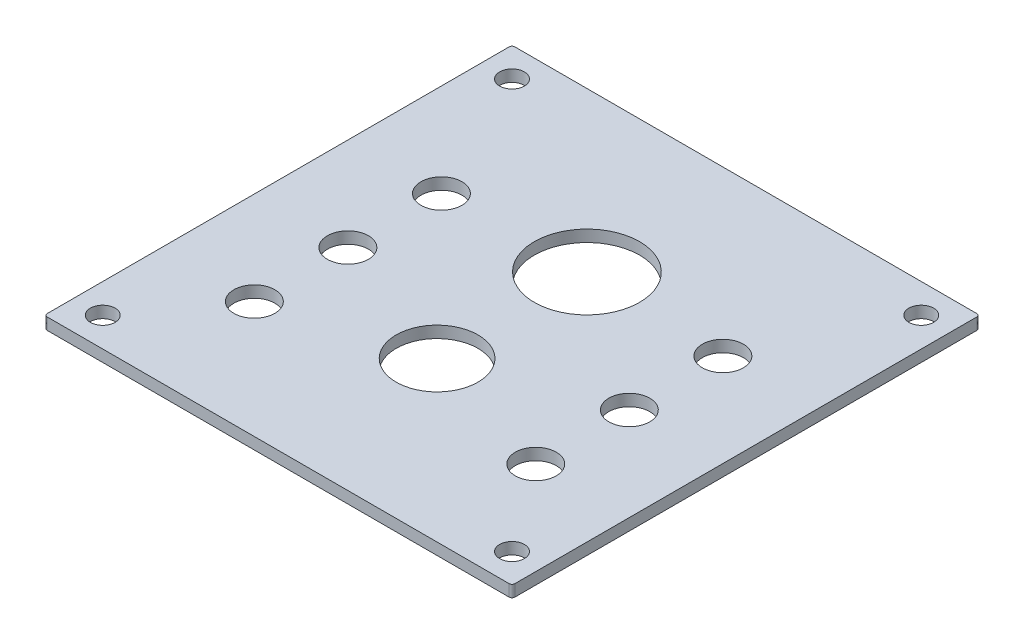
ISO-10303-21;
HEADER;
FILE_DESCRIPTION(('STEP AP214'),'2;1');
FILE_NAME('part.step','',(''),(''),'','','');
FILE_SCHEMA(('AUTOMOTIVE_DESIGN { 1 0 10303 214 1 1 1 1 }'));
ENDSEC;
DATA;
#1=APPLICATION_CONTEXT('core data for automotive mechanical design processes');
#2=APPLICATION_PROTOCOL_DEFINITION('international standard','automotive_design',2000,#1);
#3=PRODUCT_CONTEXT('',#1,'mechanical');
#4=PRODUCT('Part','Part','',(#3));
#5=PRODUCT_RELATED_PRODUCT_CATEGORY('part','',(#4));
#6=PRODUCT_DEFINITION_FORMATION('','',#4);
#7=PRODUCT_DEFINITION_CONTEXT('part definition',#1,'design');
#8=PRODUCT_DEFINITION('design','',#6,#7);
#9=PRODUCT_DEFINITION_SHAPE('','',#8);
#10=(LENGTH_UNIT() NAMED_UNIT(*) SI_UNIT(.MILLI.,.METRE.));
#11=(NAMED_UNIT(*) PLANE_ANGLE_UNIT() SI_UNIT($,.RADIAN.));
#12=(NAMED_UNIT(*) SI_UNIT($,.STERADIAN.) SOLID_ANGLE_UNIT());
#13=UNCERTAINTY_MEASURE_WITH_UNIT(LENGTH_MEASURE(1.E-05),#10,'distance_accuracy_value','');
#14=(GEOMETRIC_REPRESENTATION_CONTEXT(3) GLOBAL_UNCERTAINTY_ASSIGNED_CONTEXT((#13)) GLOBAL_UNIT_ASSIGNED_CONTEXT((#10,
#11,#12)) REPRESENTATION_CONTEXT('',''));
#15=CARTESIAN_POINT('',(0.,0.,0.));
#16=DIRECTION('',(0.,0.,1.));
#17=DIRECTION('',(1.,0.,0.));
#18=AXIS2_PLACEMENT_3D('',#15,#16,#17);
#19=CARTESIAN_POINT('',(76.3793482367759,0.,47.8960232997481));
#20=DIRECTION('',(0.,-1.,0.));
#21=DIRECTION('',(0.,0.,-1.));
#22=AXIS2_PLACEMENT_3D('',#19,#20,#21);
#23=CYLINDRICAL_SURFACE('',#22,0.793749999999989);
#24=CARTESIAN_POINT('',(76.3793482367759,0.,47.8960232997481));
#25=DIRECTION('',(0.,-1.,0.));
#26=DIRECTION('',(0.,0.,-1.));
#27=AXIS2_PLACEMENT_3D('',#24,#25,#26);
#28=CIRCLE('',#27,0.793749999999989);
#29=CARTESIAN_POINT('',(77.1730982367758,0.,47.8960232997481));
#30=VERTEX_POINT('',#29);
#31=CARTESIAN_POINT('',(76.3793482367759,0.,48.6897732997481));
#32=VERTEX_POINT('',#31);
#33=EDGE_CURVE('E85',#30,#32,#28,.T.);
#34=ORIENTED_EDGE('',*,*,#33,.T.);
#35=DIRECTION('',(0.,1.,0.));
#36=VECTOR('',#35,1.);
#37=CARTESIAN_POINT('',(76.3793482367759,0.,48.6897732997481));
#38=LINE('',#37,#36);
#39=CARTESIAN_POINT('',(76.3793482367759,-3.175,48.6897732997481));
#40=VERTEX_POINT('',#39);
#41=EDGE_CURVE('E120',#40,#32,#38,.T.);
#42=ORIENTED_EDGE('',*,*,#41,.F.);
#43=CARTESIAN_POINT('',(76.3793482367759,-3.175,47.8960232997481));
#44=DIRECTION('',(0.,-1.,0.));
#45=DIRECTION('',(0.,0.,-1.));
#46=AXIS2_PLACEMENT_3D('',#43,#44,#45);
#47=CIRCLE('',#46,0.793749999999989);
#48=CARTESIAN_POINT('',(77.1730982367758,-3.175,47.8960232997481));
#49=VERTEX_POINT('',#48);
#50=EDGE_CURVE('E20',#40,#49,#47,.F.);
#51=ORIENTED_EDGE('',*,*,#50,.T.);
#52=DIRECTION('',(0.,1.,0.));
#53=VECTOR('',#52,1.);
#54=CARTESIAN_POINT('',(77.1730982367758,0.,47.8960232997481));
#55=LINE('',#54,#53);
#56=EDGE_CURVE('E106',#30,#49,#55,.F.);
#57=ORIENTED_EDGE('',*,*,#56,.F.);
#58=EDGE_LOOP('',(#34,#42,#51,#57));
#59=FACE_BOUND('',#58,.T.);
#60=ADVANCED_FACE('F17',(#59),#23,.T.);
#61=CARTESIAN_POINT('',(-49.0331517632242,0.,47.8960232997481));
#62=DIRECTION('',(0.,-1.,0.));
#63=DIRECTION('',(0.,0.,-1.));
#64=AXIS2_PLACEMENT_3D('',#61,#62,#63);
#65=CYLINDRICAL_SURFACE('',#64,0.79375000000001);
#66=CARTESIAN_POINT('',(-49.0331517632242,0.,47.8960232997481));
#67=DIRECTION('',(0.,-1.,0.));
#68=DIRECTION('',(0.,0.,-1.));
#69=AXIS2_PLACEMENT_3D('',#66,#67,#68);
#70=CIRCLE('',#69,0.79375000000001);
#71=CARTESIAN_POINT('',(-49.0331517632242,0.,48.6897732997481));
#72=VERTEX_POINT('',#71);
#73=CARTESIAN_POINT('',(-49.8269017632242,0.,47.8960232997481));
#74=VERTEX_POINT('',#73);
#75=EDGE_CURVE('E202',#72,#74,#70,.T.);
#76=ORIENTED_EDGE('',*,*,#75,.T.);
#77=DIRECTION('',(0.,1.,0.));
#78=VECTOR('',#77,1.);
#79=CARTESIAN_POINT('',(-49.8269017632242,0.,47.8960232997481));
#80=LINE('',#79,#78);
#81=CARTESIAN_POINT('',(-49.8269017632242,-3.175,47.8960232997481));
#82=VERTEX_POINT('',#81);
#83=EDGE_CURVE('E128',#82,#74,#80,.T.);
#84=ORIENTED_EDGE('',*,*,#83,.F.);
#85=CARTESIAN_POINT('',(-49.0331517632242,-3.175,47.8960232997481));
#86=DIRECTION('',(0.,-1.,0.));
#87=DIRECTION('',(0.,0.,-1.));
#88=AXIS2_PLACEMENT_3D('',#85,#86,#87);
#89=CIRCLE('',#88,0.79375000000001);
#90=CARTESIAN_POINT('',(-49.0331517632242,-3.175,48.6897732997481));
#91=VERTEX_POINT('',#90);
#92=EDGE_CURVE('E205',#82,#91,#89,.F.);
#93=ORIENTED_EDGE('',*,*,#92,.T.);
#94=DIRECTION('',(0.,1.,0.));
#95=VECTOR('',#94,1.);
#96=CARTESIAN_POINT('',(-49.0331517632242,0.,48.6897732997481));
#97=LINE('',#96,#95);
#98=EDGE_CURVE('E117',#72,#91,#97,.F.);
#99=ORIENTED_EDGE('',*,*,#98,.F.);
#100=EDGE_LOOP('',(#76,#84,#93,#99));
#101=FACE_BOUND('',#100,.T.);
#102=ADVANCED_FACE('F210',(#101),#65,.T.);
#103=CARTESIAN_POINT('',(-49.0331517632242,0.,-77.5164767002519));
#104=DIRECTION('',(0.,-1.,0.));
#105=DIRECTION('',(0.,0.,-1.));
#106=AXIS2_PLACEMENT_3D('',#103,#104,#105);
#107=CYLINDRICAL_SURFACE('',#106,0.793749999999996);
#108=CARTESIAN_POINT('',(-49.0331517632242,0.,-77.5164767002519));
#109=DIRECTION('',(0.,-1.,0.));
#110=DIRECTION('',(0.,0.,-1.));
#111=AXIS2_PLACEMENT_3D('',#108,#109,#110);
#112=CIRCLE('',#111,0.793749999999996);
#113=CARTESIAN_POINT('',(-49.8269017632242,0.,-77.5164767002519));
#114=VERTEX_POINT('',#113);
#115=CARTESIAN_POINT('',(-49.0331517632242,0.,-78.3102267002519));
#116=VERTEX_POINT('',#115);
#117=EDGE_CURVE('E200',#114,#116,#112,.T.);
#118=ORIENTED_EDGE('',*,*,#117,.T.);
#119=DIRECTION('',(0.,1.,0.));
#120=VECTOR('',#119,1.);
#121=CARTESIAN_POINT('',(-49.0331517632242,0.,-78.3102267002519));
#122=LINE('',#121,#120);
#123=CARTESIAN_POINT('',(-49.0331517632242,-3.175,-78.3102267002519));
#124=VERTEX_POINT('',#123);
#125=EDGE_CURVE('E123',#124,#116,#122,.T.);
#126=ORIENTED_EDGE('',*,*,#125,.F.);
#127=CARTESIAN_POINT('',(-49.0331517632242,-3.175,-77.5164767002519));
#128=DIRECTION('',(0.,-1.,0.));
#129=DIRECTION('',(0.,0.,-1.));
#130=AXIS2_PLACEMENT_3D('',#127,#128,#129);
#131=CIRCLE('',#130,0.793749999999996);
#132=CARTESIAN_POINT('',(-49.8269017632242,-3.175,-77.5164767002519));
#133=VERTEX_POINT('',#132);
#134=EDGE_CURVE('E34',#124,#133,#131,.F.);
#135=ORIENTED_EDGE('',*,*,#134,.T.);
#136=DIRECTION('',(0.,1.,0.));
#137=VECTOR('',#136,1.);
#138=CARTESIAN_POINT('',(-49.8269017632242,0.,-77.5164767002519));
#139=LINE('',#138,#137);
#140=EDGE_CURVE('E127',#114,#133,#139,.F.);
#141=ORIENTED_EDGE('',*,*,#140,.F.);
#142=EDGE_LOOP('',(#118,#126,#135,#141));
#143=FACE_BOUND('',#142,.T.);
#144=ADVANCED_FACE('F234',(#143),#107,.T.);
#145=CARTESIAN_POINT('',(76.3793482367759,0.,-77.5164767002519));
#146=DIRECTION('',(0.,-1.,0.));
#147=DIRECTION('',(0.,0.,-1.));
#148=AXIS2_PLACEMENT_3D('',#145,#146,#147);
#149=PLANE('',#148);
#150=DIRECTION('',(-1.,0.,0.));
#151=VECTOR('',#150,1.);
#152=CARTESIAN_POINT('',(-49.0331517632242,0.,-78.3102267002519));
#153=LINE('',#152,#151);
#154=CARTESIAN_POINT('',(76.3793482367759,0.,-78.3102267002519));
#155=VERTEX_POINT('',#154);
#156=EDGE_CURVE('E121',#116,#155,#153,.F.);
#157=ORIENTED_EDGE('',*,*,#156,.F.);
#158=ORIENTED_EDGE('',*,*,#117,.F.);
#159=DIRECTION('',(0.,0.,1.));
#160=VECTOR('',#159,1.);
#161=CARTESIAN_POINT('',(-49.8269017632242,0.,47.8960232997481));
#162=LINE('',#161,#160);
#163=EDGE_CURVE('E124',#74,#114,#162,.F.);
#164=ORIENTED_EDGE('',*,*,#163,.F.);
#165=ORIENTED_EDGE('',*,*,#75,.F.);
#166=DIRECTION('',(1.,0.,0.));
#167=VECTOR('',#166,1.);
#168=CARTESIAN_POINT('',(76.3793482367759,0.,48.6897732997481));
#169=LINE('',#168,#167);
#170=EDGE_CURVE('E129',#32,#72,#169,.F.);
#171=ORIENTED_EDGE('',*,*,#170,.F.);
#172=ORIENTED_EDGE('',*,*,#33,.F.);
#173=DIRECTION('',(0.,0.,-1.));
#174=VECTOR('',#173,1.);
#175=CARTESIAN_POINT('',(77.1730982367758,0.,-77.5164767002519));
#176=LINE('',#175,#174);
#177=CARTESIAN_POINT('',(77.1730982367758,0.,-77.5164767002519));
#178=VERTEX_POINT('',#177);
#179=EDGE_CURVE('E102',#178,#30,#176,.F.);
#180=ORIENTED_EDGE('',*,*,#179,.F.);
#181=CARTESIAN_POINT('',(76.3793482367759,0.,-77.5164767002519));
#182=DIRECTION('',(0.,-1.,0.));
#183=DIRECTION('',(0.,0.,-1.));
#184=AXIS2_PLACEMENT_3D('',#181,#182,#183);
#185=CIRCLE('',#184,0.793749999999996);
#186=EDGE_CURVE('E90',#155,#178,#185,.T.);
#187=ORIENTED_EDGE('',*,*,#186,.F.);
#188=EDGE_LOOP('',(#157,#158,#164,#165,#171,#172,#180,#187));
#189=FACE_BOUND('',#188,.T.);
#190=CARTESIAN_POINT('',(-24.5351467305084,0.,-33.8602267002519));
#191=DIRECTION('',(0.,-1.,0.));
#192=DIRECTION('',(0.,0.,-1.));
#193=AXIS2_PLACEMENT_3D('',#190,#191,#192);
#194=CIRCLE('',#193,5.5626);
#195=CARTESIAN_POINT('',(-24.5351467305084,0.,-39.4228267002519));
#196=VERTEX_POINT('',#195);
#197=EDGE_CURVE('E110',#196,#196,#194,.T.);
#198=ORIENTED_EDGE('',*,*,#197,.T.);
#199=EDGE_LOOP('',(#198));
#200=FACE_BOUND('',#199,.T.);
#201=CARTESIAN_POINT('',(51.88134320406,0.,16.9397732997481));
#202=DIRECTION('',(0.,-1.,0.));
#203=DIRECTION('',(0.,0.,-1.));
#204=AXIS2_PLACEMENT_3D('',#201,#202,#203);
#205=CIRCLE('',#204,5.5626);
#206=CARTESIAN_POINT('',(51.88134320406,0.,11.3771732997481));
#207=VERTEX_POINT('',#206);
#208=EDGE_CURVE('E113',#207,#207,#205,.T.);
#209=ORIENTED_EDGE('',*,*,#208,.T.);
#210=EDGE_LOOP('',(#209));
#211=FACE_BOUND('',#210,.T.);
#212=CARTESIAN_POINT('',(-24.5351467305084,0.,-8.4602267002519));
#213=DIRECTION('',(0.,-1.,0.));
#214=DIRECTION('',(0.,0.,-1.));
#215=AXIS2_PLACEMENT_3D('',#212,#213,#214);
#216=CIRCLE('',#215,5.5626);
#217=CARTESIAN_POINT('',(-24.5351467305084,0.,-14.0228267002519));
#218=VERTEX_POINT('',#217);
#219=EDGE_CURVE('E170',#218,#218,#216,.T.);
#220=ORIENTED_EDGE('',*,*,#219,.T.);
#221=EDGE_LOOP('',(#220));
#222=FACE_BOUND('',#221,.T.);
#223=CARTESIAN_POINT('',(13.6730982367758,0.,-35.1556267002519));
#224=DIRECTION('',(0.,-1.,0.));
#225=DIRECTION('',(0.,0.,-1.));
#226=AXIS2_PLACEMENT_3D('',#223,#224,#225);
#227=CIRCLE('',#226,14.2875);
#228=CARTESIAN_POINT('',(13.6730982367758,0.,-49.4431267002519));
#229=VERTEX_POINT('',#228);
#230=EDGE_CURVE('E173',#229,#229,#227,.T.);
#231=ORIENTED_EDGE('',*,*,#230,.T.);
#232=EDGE_LOOP('',(#231));
#233=FACE_BOUND('',#232,.T.);
#234=CARTESIAN_POINT('',(-41.8894017632242,0.,-70.3727267002519));
#235=DIRECTION('',(0.,-1.,0.));
#236=DIRECTION('',(0.,0.,-1.));
#237=AXIS2_PLACEMENT_3D('',#234,#235,#236);
#238=CIRCLE('',#237,3.3528);
#239=CARTESIAN_POINT('',(-41.8894017632242,0.,-73.7255267002519));
#240=VERTEX_POINT('',#239);
#241=EDGE_CURVE('E176',#240,#240,#238,.T.);
#242=ORIENTED_EDGE('',*,*,#241,.T.);
#243=EDGE_LOOP('',(#242));
#244=FACE_BOUND('',#243,.T.);
#245=CARTESIAN_POINT('',(69.2355982367758,0.,40.7522732997481));
#246=DIRECTION('',(0.,-1.,0.));
#247=DIRECTION('',(0.,0.,-1.));
#248=AXIS2_PLACEMENT_3D('',#245,#246,#247);
#249=CIRCLE('',#248,3.3528);
#250=CARTESIAN_POINT('',(69.2355982367758,0.,37.3994732997481));
#251=VERTEX_POINT('',#250);
#252=EDGE_CURVE('E179',#251,#251,#249,.T.);
#253=ORIENTED_EDGE('',*,*,#252,.T.);
#254=EDGE_LOOP('',(#253));
#255=FACE_BOUND('',#254,.T.);
#256=CARTESIAN_POINT('',(69.2355982367759,0.,-70.3727267002519));
#257=DIRECTION('',(0.,-1.,0.));
#258=DIRECTION('',(0.,0.,-1.));
#259=AXIS2_PLACEMENT_3D('',#256,#257,#258);
#260=CIRCLE('',#259,3.3528);
#261=CARTESIAN_POINT('',(69.2355982367759,0.,-73.7255267002519));
#262=VERTEX_POINT('',#261);
#263=EDGE_CURVE('E182',#262,#262,#260,.T.);
#264=ORIENTED_EDGE('',*,*,#263,.T.);
#265=EDGE_LOOP('',(#264));
#266=FACE_BOUND('',#265,.T.);
#267=CARTESIAN_POINT('',(13.6730982367758,0.,5.53517329974811));
#268=DIRECTION('',(0.,-1.,0.));
#269=DIRECTION('',(0.,0.,-1.));
#270=AXIS2_PLACEMENT_3D('',#267,#268,#269);
#271=CIRCLE('',#270,11.1125);
#272=CARTESIAN_POINT('',(13.6730982367758,0.,-5.57732670025189));
#273=VERTEX_POINT('',#272);
#274=EDGE_CURVE('E185',#273,#273,#271,.T.);
#275=ORIENTED_EDGE('',*,*,#274,.T.);
#276=EDGE_LOOP('',(#275));
#277=FACE_BOUND('',#276,.T.);
#278=CARTESIAN_POINT('',(-41.8894017632242,0.,40.7522732997481));
#279=DIRECTION('',(0.,-1.,0.));
#280=DIRECTION('',(0.,0.,-1.));
#281=AXIS2_PLACEMENT_3D('',#278,#279,#280);
#282=CIRCLE('',#281,3.3528);
#283=CARTESIAN_POINT('',(-41.8894017632242,0.,37.3994732997481));
#284=VERTEX_POINT('',#283);
#285=EDGE_CURVE('E188',#284,#284,#282,.T.);
#286=ORIENTED_EDGE('',*,*,#285,.T.);
#287=EDGE_LOOP('',(#286));
#288=FACE_BOUND('',#287,.T.);
#289=CARTESIAN_POINT('',(-24.5351467305084,0.,16.9397732997481));
#290=DIRECTION('',(0.,-1.,0.));
#291=DIRECTION('',(0.,0.,-1.));
#292=AXIS2_PLACEMENT_3D('',#289,#290,#291);
#293=CIRCLE('',#292,5.5626);
#294=CARTESIAN_POINT('',(-24.5351467305084,0.,11.3771732997481));
#295=VERTEX_POINT('',#294);
#296=EDGE_CURVE('E191',#295,#295,#293,.T.);
#297=ORIENTED_EDGE('',*,*,#296,.T.);
#298=EDGE_LOOP('',(#297));
#299=FACE_BOUND('',#298,.T.);
#300=CARTESIAN_POINT('',(51.8813432040601,0.,-33.8602267002519));
#301=DIRECTION('',(0.,-1.,0.));
#302=DIRECTION('',(0.,0.,-1.));
#303=AXIS2_PLACEMENT_3D('',#300,#301,#302);
#304=CIRCLE('',#303,5.5626);
#305=CARTESIAN_POINT('',(51.8813432040601,0.,-39.4228267002519));
#306=VERTEX_POINT('',#305);
#307=EDGE_CURVE('E194',#306,#306,#304,.T.);
#308=ORIENTED_EDGE('',*,*,#307,.T.);
#309=EDGE_LOOP('',(#308));
#310=FACE_BOUND('',#309,.T.);
#311=CARTESIAN_POINT('',(51.8813432040601,0.,-8.4602267002519));
#312=DIRECTION('',(0.,-1.,0.));
#313=DIRECTION('',(0.,0.,-1.));
#314=AXIS2_PLACEMENT_3D('',#311,#312,#313);
#315=CIRCLE('',#314,5.5626);
#316=CARTESIAN_POINT('',(51.8813432040601,0.,-14.0228267002519));
#317=VERTEX_POINT('',#316);
#318=EDGE_CURVE('E99',#317,#317,#315,.T.);
#319=ORIENTED_EDGE('',*,*,#318,.T.);
#320=EDGE_LOOP('',(#319));
#321=FACE_BOUND('',#320,.T.);
#322=ADVANCED_FACE('F103',(#189,#200,#211,#222,#233,#244,#255,#266,#277,#288,#299,#310,#321),
#149,.F.);
#323=CARTESIAN_POINT('',(76.3793482367759,0.,-77.5164767002519));
#324=DIRECTION('',(0.,-1.,0.));
#325=DIRECTION('',(0.,0.,-1.));
#326=AXIS2_PLACEMENT_3D('',#323,#324,#325);
#327=CYLINDRICAL_SURFACE('',#326,0.793749999999996);
#328=ORIENTED_EDGE('',*,*,#186,.T.);
#329=DIRECTION('',(0.,1.,0.));
#330=VECTOR('',#329,1.);
#331=CARTESIAN_POINT('',(77.1730982367758,0.,-77.5164767002519));
#332=LINE('',#331,#330);
#333=CARTESIAN_POINT('',(77.1730982367758,-3.175,-77.5164767002519));
#334=VERTEX_POINT('',#333);
#335=EDGE_CURVE('E93',#334,#178,#332,.T.);
#336=ORIENTED_EDGE('',*,*,#335,.F.);
#337=CARTESIAN_POINT('',(76.3793482367759,-3.175,-77.5164767002519));
#338=DIRECTION('',(0.,-1.,0.));
#339=DIRECTION('',(0.,0.,-1.));
#340=AXIS2_PLACEMENT_3D('',#337,#338,#339);
#341=CIRCLE('',#340,0.793749999999996);
#342=CARTESIAN_POINT('',(76.3793482367759,-3.175,-78.3102267002519));
#343=VERTEX_POINT('',#342);
#344=EDGE_CURVE('E60',#334,#343,#341,.F.);
#345=ORIENTED_EDGE('',*,*,#344,.T.);
#346=DIRECTION('',(0.,1.,0.));
#347=VECTOR('',#346,1.);
#348=CARTESIAN_POINT('',(76.3793482367759,0.,-78.3102267002519));
#349=LINE('',#348,#347);
#350=EDGE_CURVE('E96',#155,#343,#349,.F.);
#351=ORIENTED_EDGE('',*,*,#350,.F.);
#352=EDGE_LOOP('',(#328,#336,#345,#351));
#353=FACE_BOUND('',#352,.T.);
#354=ADVANCED_FACE('F91',(#353),#327,.T.);
#355=CARTESIAN_POINT('',(51.8813432040601,0.,-8.4602267002519));
#356=DIRECTION('',(0.,-1.,0.));
#357=DIRECTION('',(0.,0.,-1.));
#358=AXIS2_PLACEMENT_3D('',#355,#356,#357);
#359=CYLINDRICAL_SURFACE('',#358,5.5626);
#360=CARTESIAN_POINT('',(51.8813432040601,-3.175,-8.4602267002519));
#361=DIRECTION('',(0.,-1.,0.));
#362=DIRECTION('',(0.,0.,-1.));
#363=AXIS2_PLACEMENT_3D('',#360,#361,#362);
#364=CIRCLE('',#363,5.5626);
#365=CARTESIAN_POINT('',(51.8813432040601,-3.175,-14.0228267002519));
#366=VERTEX_POINT('',#365);
#367=EDGE_CURVE('E165',#366,#366,#364,.F.);
#368=ORIENTED_EDGE('',*,*,#367,.F.);
#369=EDGE_LOOP('',(#368));
#370=FACE_BOUND('',#369,.T.);
#371=ORIENTED_EDGE('',*,*,#318,.F.);
#372=EDGE_LOOP('',(#371));
#373=FACE_BOUND('',#372,.T.);
#374=ADVANCED_FACE('F295',(#370,#373),#359,.F.);
#375=CARTESIAN_POINT('',(51.8813432040601,0.,-33.8602267002519));
#376=DIRECTION('',(0.,-1.,0.));
#377=DIRECTION('',(0.,0.,-1.));
#378=AXIS2_PLACEMENT_3D('',#375,#376,#377);
#379=CYLINDRICAL_SURFACE('',#378,5.5626);
#380=CARTESIAN_POINT('',(51.8813432040601,-3.175,-33.8602267002519));
#381=DIRECTION('',(0.,-1.,0.));
#382=DIRECTION('',(0.,0.,-1.));
#383=AXIS2_PLACEMENT_3D('',#380,#381,#382);
#384=CIRCLE('',#383,5.5626);
#385=CARTESIAN_POINT('',(51.8813432040601,-3.175,-39.4228267002519));
#386=VERTEX_POINT('',#385);
#387=EDGE_CURVE('E162',#386,#386,#384,.F.);
#388=ORIENTED_EDGE('',*,*,#387,.F.);
#389=EDGE_LOOP('',(#388));
#390=FACE_BOUND('',#389,.T.);
#391=ORIENTED_EDGE('',*,*,#307,.F.);
#392=EDGE_LOOP('',(#391));
#393=FACE_BOUND('',#392,.T.);
#394=ADVANCED_FACE('F291',(#390,#393),#379,.F.);
#395=CARTESIAN_POINT('',(-24.5351467305084,0.,16.9397732997481));
#396=DIRECTION('',(0.,-1.,0.));
#397=DIRECTION('',(0.,0.,-1.));
#398=AXIS2_PLACEMENT_3D('',#395,#396,#397);
#399=CYLINDRICAL_SURFACE('',#398,5.5626);
#400=CARTESIAN_POINT('',(-24.5351467305084,-3.175,16.9397732997481));
#401=DIRECTION('',(0.,-1.,0.));
#402=DIRECTION('',(0.,0.,-1.));
#403=AXIS2_PLACEMENT_3D('',#400,#401,#402);
#404=CIRCLE('',#403,5.5626);
#405=CARTESIAN_POINT('',(-24.5351467305084,-3.175,11.3771732997481));
#406=VERTEX_POINT('',#405);
#407=EDGE_CURVE('E159',#406,#406,#404,.F.);
#408=ORIENTED_EDGE('',*,*,#407,.F.);
#409=EDGE_LOOP('',(#408));
#410=FACE_BOUND('',#409,.T.);
#411=ORIENTED_EDGE('',*,*,#296,.F.);
#412=EDGE_LOOP('',(#411));
#413=FACE_BOUND('',#412,.T.);
#414=ADVANCED_FACE('F287',(#410,#413),#399,.F.);
#415=CARTESIAN_POINT('',(-41.8894017632242,0.,40.7522732997481));
#416=DIRECTION('',(0.,-1.,0.));
#417=DIRECTION('',(0.,0.,-1.));
#418=AXIS2_PLACEMENT_3D('',#415,#416,#417);
#419=CYLINDRICAL_SURFACE('',#418,3.3528);
#420=CARTESIAN_POINT('',(-41.8894017632242,-3.175,40.7522732997481));
#421=DIRECTION('',(0.,-1.,0.));
#422=DIRECTION('',(0.,0.,-1.));
#423=AXIS2_PLACEMENT_3D('',#420,#421,#422);
#424=CIRCLE('',#423,3.3528);
#425=CARTESIAN_POINT('',(-41.8894017632242,-3.175,37.3994732997481));
#426=VERTEX_POINT('',#425);
#427=EDGE_CURVE('E156',#426,#426,#424,.F.);
#428=ORIENTED_EDGE('',*,*,#427,.F.);
#429=EDGE_LOOP('',(#428));
#430=FACE_BOUND('',#429,.T.);
#431=ORIENTED_EDGE('',*,*,#285,.F.);
#432=EDGE_LOOP('',(#431));
#433=FACE_BOUND('',#432,.T.);
#434=ADVANCED_FACE('F283',(#430,#433),#419,.F.);
#435=CARTESIAN_POINT('',(13.6730982367758,0.,5.53517329974811));
#436=DIRECTION('',(0.,-1.,0.));
#437=DIRECTION('',(0.,0.,-1.));
#438=AXIS2_PLACEMENT_3D('',#435,#436,#437);
#439=CYLINDRICAL_SURFACE('',#438,11.1125);
#440=CARTESIAN_POINT('',(13.6730982367758,-3.175,5.53517329974811));
#441=DIRECTION('',(0.,-1.,0.));
#442=DIRECTION('',(0.,0.,-1.));
#443=AXIS2_PLACEMENT_3D('',#440,#441,#442);
#444=CIRCLE('',#443,11.1125);
#445=CARTESIAN_POINT('',(13.6730982367758,-3.175,-5.57732670025189));
#446=VERTEX_POINT('',#445);
#447=EDGE_CURVE('E153',#446,#446,#444,.F.);
#448=ORIENTED_EDGE('',*,*,#447,.F.);
#449=EDGE_LOOP('',(#448));
#450=FACE_BOUND('',#449,.T.);
#451=ORIENTED_EDGE('',*,*,#274,.F.);
#452=EDGE_LOOP('',(#451));
#453=FACE_BOUND('',#452,.T.);
#454=ADVANCED_FACE('F279',(#450,#453),#439,.F.);
#455=CARTESIAN_POINT('',(69.2355982367759,0.,-70.3727267002519));
#456=DIRECTION('',(0.,-1.,0.));
#457=DIRECTION('',(0.,0.,-1.));
#458=AXIS2_PLACEMENT_3D('',#455,#456,#457);
#459=CYLINDRICAL_SURFACE('',#458,3.3528);
#460=CARTESIAN_POINT('',(69.2355982367759,-3.175,-70.3727267002519));
#461=DIRECTION('',(0.,-1.,0.));
#462=DIRECTION('',(0.,0.,-1.));
#463=AXIS2_PLACEMENT_3D('',#460,#461,#462);
#464=CIRCLE('',#463,3.3528);
#465=CARTESIAN_POINT('',(69.2355982367759,-3.175,-73.7255267002519));
#466=VERTEX_POINT('',#465);
#467=EDGE_CURVE('E150',#466,#466,#464,.F.);
#468=ORIENTED_EDGE('',*,*,#467,.F.);
#469=EDGE_LOOP('',(#468));
#470=FACE_BOUND('',#469,.T.);
#471=ORIENTED_EDGE('',*,*,#263,.F.);
#472=EDGE_LOOP('',(#471));
#473=FACE_BOUND('',#472,.T.);
#474=ADVANCED_FACE('F275',(#470,#473),#459,.F.);
#475=CARTESIAN_POINT('',(69.2355982367758,0.,40.7522732997481));
#476=DIRECTION('',(0.,-1.,0.));
#477=DIRECTION('',(0.,0.,-1.));
#478=AXIS2_PLACEMENT_3D('',#475,#476,#477);
#479=CYLINDRICAL_SURFACE('',#478,3.3528);
#480=CARTESIAN_POINT('',(69.2355982367758,-3.175,40.7522732997481));
#481=DIRECTION('',(0.,-1.,0.));
#482=DIRECTION('',(0.,0.,-1.));
#483=AXIS2_PLACEMENT_3D('',#480,#481,#482);
#484=CIRCLE('',#483,3.3528);
#485=CARTESIAN_POINT('',(69.2355982367758,-3.175,37.3994732997481));
#486=VERTEX_POINT('',#485);
#487=EDGE_CURVE('E147',#486,#486,#484,.F.);
#488=ORIENTED_EDGE('',*,*,#487,.F.);
#489=EDGE_LOOP('',(#488));
#490=FACE_BOUND('',#489,.T.);
#491=ORIENTED_EDGE('',*,*,#252,.F.);
#492=EDGE_LOOP('',(#491));
#493=FACE_BOUND('',#492,.T.);
#494=ADVANCED_FACE('F271',(#490,#493),#479,.F.);
#495=CARTESIAN_POINT('',(-41.8894017632242,0.,-70.3727267002519));
#496=DIRECTION('',(0.,-1.,0.));
#497=DIRECTION('',(0.,0.,-1.));
#498=AXIS2_PLACEMENT_3D('',#495,#496,#497);
#499=CYLINDRICAL_SURFACE('',#498,3.3528);
#500=CARTESIAN_POINT('',(-41.8894017632242,-3.175,-70.3727267002519));
#501=DIRECTION('',(0.,-1.,0.));
#502=DIRECTION('',(0.,0.,-1.));
#503=AXIS2_PLACEMENT_3D('',#500,#501,#502);
#504=CIRCLE('',#503,3.3528);
#505=CARTESIAN_POINT('',(-41.8894017632242,-3.175,-73.7255267002519));
#506=VERTEX_POINT('',#505);
#507=EDGE_CURVE('E144',#506,#506,#504,.F.);
#508=ORIENTED_EDGE('',*,*,#507,.F.);
#509=EDGE_LOOP('',(#508));
#510=FACE_BOUND('',#509,.T.);
#511=ORIENTED_EDGE('',*,*,#241,.F.);
#512=EDGE_LOOP('',(#511));
#513=FACE_BOUND('',#512,.T.);
#514=ADVANCED_FACE('F267',(#510,#513),#499,.F.);
#515=CARTESIAN_POINT('',(13.6730982367758,0.,-35.1556267002519));
#516=DIRECTION('',(0.,-1.,0.));
#517=DIRECTION('',(0.,0.,-1.));
#518=AXIS2_PLACEMENT_3D('',#515,#516,#517);
#519=CYLINDRICAL_SURFACE('',#518,14.2875);
#520=CARTESIAN_POINT('',(13.6730982367758,-3.175,-35.1556267002519));
#521=DIRECTION('',(0.,-1.,0.));
#522=DIRECTION('',(0.,0.,-1.));
#523=AXIS2_PLACEMENT_3D('',#520,#521,#522);
#524=CIRCLE('',#523,14.2875);
#525=CARTESIAN_POINT('',(13.6730982367758,-3.175,-49.4431267002519));
#526=VERTEX_POINT('',#525);
#527=EDGE_CURVE('E141',#526,#526,#524,.F.);
#528=ORIENTED_EDGE('',*,*,#527,.F.);
#529=EDGE_LOOP('',(#528));
#530=FACE_BOUND('',#529,.T.);
#531=ORIENTED_EDGE('',*,*,#230,.F.);
#532=EDGE_LOOP('',(#531));
#533=FACE_BOUND('',#532,.T.);
#534=ADVANCED_FACE('F263',(#530,#533),#519,.F.);
#535=CARTESIAN_POINT('',(-24.5351467305084,0.,-8.4602267002519));
#536=DIRECTION('',(0.,-1.,0.));
#537=DIRECTION('',(0.,0.,-1.));
#538=AXIS2_PLACEMENT_3D('',#535,#536,#537);
#539=CYLINDRICAL_SURFACE('',#538,5.5626);
#540=CARTESIAN_POINT('',(-24.5351467305084,-3.175,-8.4602267002519));
#541=DIRECTION('',(0.,-1.,0.));
#542=DIRECTION('',(0.,0.,-1.));
#543=AXIS2_PLACEMENT_3D('',#540,#541,#542);
#544=CIRCLE('',#543,5.5626);
#545=CARTESIAN_POINT('',(-24.5351467305084,-3.175,-14.0228267002519));
#546=VERTEX_POINT('',#545);
#547=EDGE_CURVE('E138',#546,#546,#544,.F.);
#548=ORIENTED_EDGE('',*,*,#547,.F.);
#549=EDGE_LOOP('',(#548));
#550=FACE_BOUND('',#549,.T.);
#551=ORIENTED_EDGE('',*,*,#219,.F.);
#552=EDGE_LOOP('',(#551));
#553=FACE_BOUND('',#552,.T.);
#554=ADVANCED_FACE('F259',(#550,#553),#539,.F.);
#555=CARTESIAN_POINT('',(51.88134320406,0.,16.9397732997481));
#556=DIRECTION('',(0.,-1.,0.));
#557=DIRECTION('',(0.,0.,-1.));
#558=AXIS2_PLACEMENT_3D('',#555,#556,#557);
#559=CYLINDRICAL_SURFACE('',#558,5.5626);
#560=CARTESIAN_POINT('',(51.88134320406,-3.175,16.9397732997481));
#561=DIRECTION('',(0.,-1.,0.));
#562=DIRECTION('',(0.,0.,-1.));
#563=AXIS2_PLACEMENT_3D('',#560,#561,#562);
#564=CIRCLE('',#563,5.5626);
#565=CARTESIAN_POINT('',(51.88134320406,-3.175,11.3771732997481));
#566=VERTEX_POINT('',#565);
#567=EDGE_CURVE('E135',#566,#566,#564,.F.);
#568=ORIENTED_EDGE('',*,*,#567,.F.);
#569=EDGE_LOOP('',(#568));
#570=FACE_BOUND('',#569,.T.);
#571=ORIENTED_EDGE('',*,*,#208,.F.);
#572=EDGE_LOOP('',(#571));
#573=FACE_BOUND('',#572,.T.);
#574=ADVANCED_FACE('F255',(#570,#573),#559,.F.);
#575=CARTESIAN_POINT('',(-24.5351467305084,0.,-33.8602267002519));
#576=DIRECTION('',(0.,-1.,0.));
#577=DIRECTION('',(0.,0.,-1.));
#578=AXIS2_PLACEMENT_3D('',#575,#576,#577);
#579=CYLINDRICAL_SURFACE('',#578,5.5626);
#580=CARTESIAN_POINT('',(-24.5351467305084,-3.175,-33.8602267002519));
#581=DIRECTION('',(0.,-1.,0.));
#582=DIRECTION('',(0.,0.,-1.));
#583=AXIS2_PLACEMENT_3D('',#580,#581,#582);
#584=CIRCLE('',#583,5.5626);
#585=CARTESIAN_POINT('',(-24.5351467305084,-3.175,-39.4228267002519));
#586=VERTEX_POINT('',#585);
#587=EDGE_CURVE('E132',#586,#586,#584,.F.);
#588=ORIENTED_EDGE('',*,*,#587,.F.);
#589=EDGE_LOOP('',(#588));
#590=FACE_BOUND('',#589,.T.);
#591=ORIENTED_EDGE('',*,*,#197,.F.);
#592=EDGE_LOOP('',(#591));
#593=FACE_BOUND('',#592,.T.);
#594=ADVANCED_FACE('F252',(#590,#593),#579,.F.);
#595=CARTESIAN_POINT('',(77.1730982367758,0.,-77.5164767002519));
#596=DIRECTION('',(1.,0.,0.));
#597=DIRECTION('',(0.,0.,-1.));
#598=AXIS2_PLACEMENT_3D('',#595,#596,#597);
#599=PLANE('',#598);
#600=ORIENTED_EDGE('',*,*,#179,.T.);
#601=ORIENTED_EDGE('',*,*,#56,.T.);
#602=DIRECTION('',(0.,0.,-1.));
#603=VECTOR('',#602,1.);
#604=CARTESIAN_POINT('',(77.1730982367758,-3.175,-77.5164767002519));
#605=LINE('',#604,#603);
#606=EDGE_CURVE('E109',#334,#49,#605,.F.);
#607=ORIENTED_EDGE('',*,*,#606,.F.);
#608=ORIENTED_EDGE('',*,*,#335,.T.);
#609=EDGE_LOOP('',(#600,#601,#607,#608));
#610=FACE_BOUND('',#609,.T.);
#611=ADVANCED_FACE('F108',(#610),#599,.T.);
#612=CARTESIAN_POINT('',(76.3793482367759,0.,48.6897732997481));
#613=DIRECTION('',(0.,0.,1.));
#614=DIRECTION('',(1.,0.,0.));
#615=AXIS2_PLACEMENT_3D('',#612,#613,#614);
#616=PLANE('',#615);
#617=ORIENTED_EDGE('',*,*,#170,.T.);
#618=ORIENTED_EDGE('',*,*,#98,.T.);
#619=DIRECTION('',(1.,0.,0.));
#620=VECTOR('',#619,1.);
#621=CARTESIAN_POINT('',(76.3793482367759,-3.175,48.6897732997481));
#622=LINE('',#621,#620);
#623=EDGE_CURVE('E217',#40,#91,#622,.F.);
#624=ORIENTED_EDGE('',*,*,#623,.F.);
#625=ORIENTED_EDGE('',*,*,#41,.T.);
#626=EDGE_LOOP('',(#617,#618,#624,#625));
#627=FACE_BOUND('',#626,.T.);
#628=ADVANCED_FACE('F215',(#627),#616,.T.);
#629=CARTESIAN_POINT('',(-49.8269017632242,0.,47.8960232997481));
#630=DIRECTION('',(-1.,0.,0.));
#631=DIRECTION('',(0.,0.,1.));
#632=AXIS2_PLACEMENT_3D('',#629,#630,#631);
#633=PLANE('',#632);
#634=ORIENTED_EDGE('',*,*,#163,.T.);
#635=ORIENTED_EDGE('',*,*,#140,.T.);
#636=DIRECTION('',(0.,0.,-1.));
#637=VECTOR('',#636,1.);
#638=CARTESIAN_POINT('',(-49.8269017632242,-3.175,-77.5164767002519));
#639=LINE('',#638,#637);
#640=EDGE_CURVE('E26',#82,#133,#639,.T.);
#641=ORIENTED_EDGE('',*,*,#640,.F.);
#642=ORIENTED_EDGE('',*,*,#83,.T.);
#643=EDGE_LOOP('',(#634,#635,#641,#642));
#644=FACE_BOUND('',#643,.T.);
#645=ADVANCED_FACE('F232',(#644),#633,.T.);
#646=CARTESIAN_POINT('',(-49.0331517632242,0.,-78.3102267002519));
#647=DIRECTION('',(0.,0.,-1.));
#648=DIRECTION('',(-1.,0.,0.));
#649=AXIS2_PLACEMENT_3D('',#646,#647,#648);
#650=PLANE('',#649);
#651=ORIENTED_EDGE('',*,*,#156,.T.);
#652=ORIENTED_EDGE('',*,*,#350,.T.);
#653=DIRECTION('',(1.,0.,0.));
#654=VECTOR('',#653,1.);
#655=CARTESIAN_POINT('',(76.3793482367759,-3.175,-78.3102267002519));
#656=LINE('',#655,#654);
#657=EDGE_CURVE('E11',#124,#343,#656,.T.);
#658=ORIENTED_EDGE('',*,*,#657,.F.);
#659=ORIENTED_EDGE('',*,*,#125,.T.);
#660=EDGE_LOOP('',(#651,#652,#658,#659));
#661=FACE_BOUND('',#660,.T.);
#662=ADVANCED_FACE('F237',(#661),#650,.T.);
#663=CARTESIAN_POINT('',(76.3793482367759,-3.175,-77.5164767002519));
#664=DIRECTION('',(0.,-1.,0.));
#665=DIRECTION('',(0.,0.,-1.));
#666=AXIS2_PLACEMENT_3D('',#663,#664,#665);
#667=PLANE('',#666);
#668=ORIENTED_EDGE('',*,*,#134,.F.);
#669=ORIENTED_EDGE('',*,*,#657,.T.);
#670=ORIENTED_EDGE('',*,*,#344,.F.);
#671=ORIENTED_EDGE('',*,*,#606,.T.);
#672=ORIENTED_EDGE('',*,*,#50,.F.);
#673=ORIENTED_EDGE('',*,*,#623,.T.);
#674=ORIENTED_EDGE('',*,*,#92,.F.);
#675=ORIENTED_EDGE('',*,*,#640,.T.);
#676=EDGE_LOOP('',(#668,#669,#670,#671,#672,#673,#674,#675));
#677=FACE_BOUND('',#676,.T.);
#678=ORIENTED_EDGE('',*,*,#587,.T.);
#679=EDGE_LOOP('',(#678));
#680=FACE_BOUND('',#679,.T.);
#681=ORIENTED_EDGE('',*,*,#567,.T.);
#682=EDGE_LOOP('',(#681));
#683=FACE_BOUND('',#682,.T.);
#684=ORIENTED_EDGE('',*,*,#547,.T.);
#685=EDGE_LOOP('',(#684));
#686=FACE_BOUND('',#685,.T.);
#687=ORIENTED_EDGE('',*,*,#527,.T.);
#688=EDGE_LOOP('',(#687));
#689=FACE_BOUND('',#688,.T.);
#690=ORIENTED_EDGE('',*,*,#507,.T.);
#691=EDGE_LOOP('',(#690));
#692=FACE_BOUND('',#691,.T.);
#693=ORIENTED_EDGE('',*,*,#487,.T.);
#694=EDGE_LOOP('',(#693));
#695=FACE_BOUND('',#694,.T.);
#696=ORIENTED_EDGE('',*,*,#467,.T.);
#697=EDGE_LOOP('',(#696));
#698=FACE_BOUND('',#697,.T.);
#699=ORIENTED_EDGE('',*,*,#447,.T.);
#700=EDGE_LOOP('',(#699));
#701=FACE_BOUND('',#700,.T.);
#702=ORIENTED_EDGE('',*,*,#427,.T.);
#703=EDGE_LOOP('',(#702));
#704=FACE_BOUND('',#703,.T.);
#705=ORIENTED_EDGE('',*,*,#407,.T.);
#706=EDGE_LOOP('',(#705));
#707=FACE_BOUND('',#706,.T.);
#708=ORIENTED_EDGE('',*,*,#387,.T.);
#709=EDGE_LOOP('',(#708));
#710=FACE_BOUND('',#709,.T.);
#711=ORIENTED_EDGE('',*,*,#367,.T.);
#712=EDGE_LOOP('',(#711));
#713=FACE_BOUND('',#712,.T.);
#714=ADVANCED_FACE('F218',(#677,#680,#683,#686,#689,#692,#695,#698,#701,#704,#707,#710,#713),
#667,.T.);
#715=CLOSED_SHELL('',(#60,#102,#144,#322,#354,#374,#394,#414,#434,#454,#474,#494,#514,#534,#554,
#574,#594,#611,#628,#645,#662,#714));
#716=MANIFOLD_SOLID_BREP('B1',#715);
#717=ADVANCED_BREP_SHAPE_REPRESENTATION('',(#18,#716),#14);
#718=SHAPE_DEFINITION_REPRESENTATION(#9,#717);
ENDSEC;
END-ISO-10303-21;
